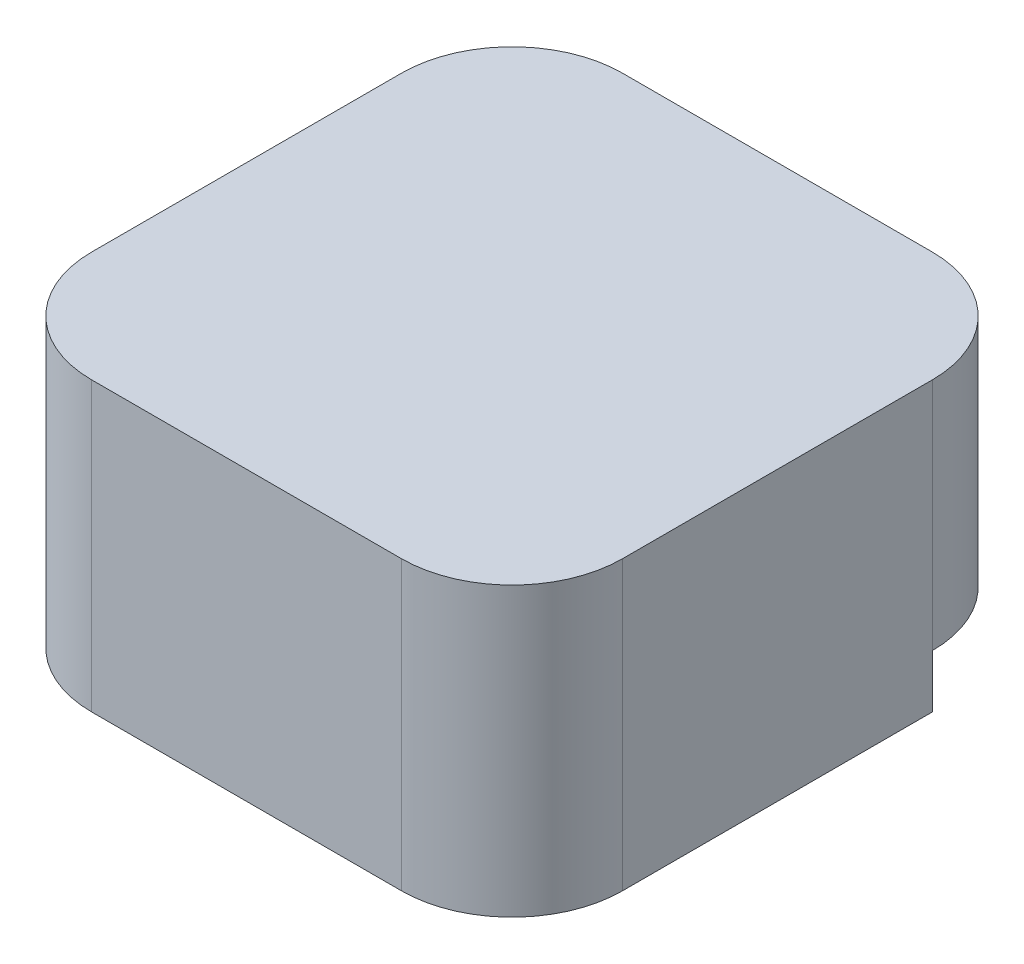
ISO-10303-21;
HEADER;
FILE_DESCRIPTION(('STEP AP214'),'2;1');
FILE_NAME('part.step','',(''),(''),'','','');
FILE_SCHEMA(('AUTOMOTIVE_DESIGN { 1 0 10303 214 1 1 1 1 }'));
ENDSEC;
DATA;
#1=APPLICATION_CONTEXT('core data for automotive mechanical design processes');
#2=APPLICATION_PROTOCOL_DEFINITION('international standard','automotive_design',2000,#1);
#3=PRODUCT_CONTEXT('',#1,'mechanical');
#4=PRODUCT('Part','Part','',(#3));
#5=PRODUCT_RELATED_PRODUCT_CATEGORY('part','',(#4));
#6=PRODUCT_DEFINITION_FORMATION('','',#4);
#7=PRODUCT_DEFINITION_CONTEXT('part definition',#1,'design');
#8=PRODUCT_DEFINITION('design','',#6,#7);
#9=PRODUCT_DEFINITION_SHAPE('','',#8);
#10=(LENGTH_UNIT() NAMED_UNIT(*) SI_UNIT(.MILLI.,.METRE.));
#11=(NAMED_UNIT(*) PLANE_ANGLE_UNIT() SI_UNIT($,.RADIAN.));
#12=(NAMED_UNIT(*) SI_UNIT($,.STERADIAN.) SOLID_ANGLE_UNIT());
#13=UNCERTAINTY_MEASURE_WITH_UNIT(LENGTH_MEASURE(1.E-05),#10,'distance_accuracy_value','');
#14=(GEOMETRIC_REPRESENTATION_CONTEXT(3) GLOBAL_UNCERTAINTY_ASSIGNED_CONTEXT((#13)) GLOBAL_UNIT_ASSIGNED_CONTEXT((#10,
#11,#12)) REPRESENTATION_CONTEXT('',''));
#15=CARTESIAN_POINT('',(0.,0.,0.));
#16=DIRECTION('',(0.,0.,1.));
#17=DIRECTION('',(1.,0.,0.));
#18=AXIS2_PLACEMENT_3D('',#15,#16,#17);
#19=CARTESIAN_POINT('',(0.,0.,0.));
#20=DIRECTION('',(0.,-1.,0.));
#21=DIRECTION('',(0.,0.,-1.));
#22=AXIS2_PLACEMENT_3D('',#19,#20,#21);
#23=PLANE('',#22);
#24=DIRECTION('',(1.,0.,0.));
#25=VECTOR('',#24,1.);
#26=CARTESIAN_POINT('',(0.,0.,-9.5));
#27=LINE('',#26,#25);
#28=CARTESIAN_POINT('',(0.,0.,-9.5));
#29=VERTEX_POINT('',#28);
#30=CARTESIAN_POINT('',(12.,0.,-9.5));
#31=VERTEX_POINT('',#30);
#32=EDGE_CURVE('E138',#29,#31,#27,.T.);
#33=ORIENTED_EDGE('',*,*,#32,.T.);
#34=DIRECTION('',(0.,0.,-1.));
#35=VECTOR('',#34,1.);
#36=CARTESIAN_POINT('',(12.,0.,0.));
#37=LINE('',#36,#35);
#38=CARTESIAN_POINT('',(12.,0.,-2.5));
#39=VERTEX_POINT('',#38);
#40=EDGE_CURVE('E177',#39,#31,#37,.T.);
#41=ORIENTED_EDGE('',*,*,#40,.F.);
#42=CARTESIAN_POINT('',(9.5,0.,-2.5));
#43=DIRECTION('',(0.,-1.,0.));
#44=DIRECTION('',(0.,0.,-1.));
#45=AXIS2_PLACEMENT_3D('',#42,#43,#44);
#46=CIRCLE('',#45,2.5);
#47=CARTESIAN_POINT('',(9.5,0.,0.));
#48=VERTEX_POINT('',#47);
#49=EDGE_CURVE('E176',#39,#48,#46,.T.);
#50=ORIENTED_EDGE('',*,*,#49,.T.);
#51=DIRECTION('',(1.,0.,0.));
#52=VECTOR('',#51,1.);
#53=CARTESIAN_POINT('',(0.,0.,0.));
#54=LINE('',#53,#52);
#55=CARTESIAN_POINT('',(2.5,0.,0.));
#56=VERTEX_POINT('',#55);
#57=EDGE_CURVE('E169',#56,#48,#54,.T.);
#58=ORIENTED_EDGE('',*,*,#57,.F.);
#59=CARTESIAN_POINT('',(2.5,0.,-2.5));
#60=DIRECTION('',(0.,-1.,0.));
#61=DIRECTION('',(0.,0.,-1.));
#62=AXIS2_PLACEMENT_3D('',#59,#60,#61);
#63=CIRCLE('',#62,2.5);
#64=CARTESIAN_POINT('',(0.,0.,-2.5));
#65=VERTEX_POINT('',#64);
#66=EDGE_CURVE('E174',#56,#65,#63,.T.);
#67=ORIENTED_EDGE('',*,*,#66,.T.);
#68=DIRECTION('',(0.,0.,1.));
#69=VECTOR('',#68,1.);
#70=CARTESIAN_POINT('',(0.,0.,0.));
#71=LINE('',#70,#69);
#72=EDGE_CURVE('E178',#29,#65,#71,.T.);
#73=ORIENTED_EDGE('',*,*,#72,.F.);
#74=EDGE_LOOP('',(#33,#41,#50,#58,#67,#73));
#75=FACE_BOUND('',#74,.T.);
#76=DIRECTION('',(-1.,0.,0.));
#77=VECTOR('',#76,1.);
#78=CARTESIAN_POINT('',(3.95,0.,-8.05));
#79=LINE('',#78,#77);
#80=CARTESIAN_POINT('',(8.05,0.,-8.05));
#81=VERTEX_POINT('',#80);
#82=CARTESIAN_POINT('',(3.95,0.,-8.05));
#83=VERTEX_POINT('',#82);
#84=EDGE_CURVE('E229',#81,#83,#79,.T.);
#85=ORIENTED_EDGE('',*,*,#84,.T.);
#86=DIRECTION('',(0.,0.,1.));
#87=VECTOR('',#86,1.);
#88=CARTESIAN_POINT('',(3.95,0.,-3.95));
#89=LINE('',#88,#87);
#90=CARTESIAN_POINT('',(3.95,0.,-3.95));
#91=VERTEX_POINT('',#90);
#92=EDGE_CURVE('E215',#83,#91,#89,.T.);
#93=ORIENTED_EDGE('',*,*,#92,.T.);
#94=DIRECTION('',(1.,0.,0.));
#95=VECTOR('',#94,1.);
#96=CARTESIAN_POINT('',(3.95,0.,-3.95));
#97=LINE('',#96,#95);
#98=CARTESIAN_POINT('',(8.05,0.,-3.95));
#99=VERTEX_POINT('',#98);
#100=EDGE_CURVE('E241',#91,#99,#97,.T.);
#101=ORIENTED_EDGE('',*,*,#100,.T.);
#102=DIRECTION('',(0.,0.,-1.));
#103=VECTOR('',#102,1.);
#104=CARTESIAN_POINT('',(8.05,0.,-3.95));
#105=LINE('',#104,#103);
#106=EDGE_CURVE('E244',#99,#81,#105,.T.);
#107=ORIENTED_EDGE('',*,*,#106,.T.);
#108=EDGE_LOOP('',(#85,#93,#101,#107));
#109=FACE_BOUND('',#108,.T.);
#110=ADVANCED_FACE('F33',(#75,#109),#23,.T.);
#111=CARTESIAN_POINT('',(0.,2.5,0.));
#112=DIRECTION('',(1.,0.,0.));
#113=DIRECTION('',(0.,0.,-1.));
#114=AXIS2_PLACEMENT_3D('',#111,#112,#113);
#115=PLANE('',#114);
#116=DIRECTION('',(0.,0.,1.));
#117=VECTOR('',#116,1.);
#118=CARTESIAN_POINT('',(0.,6.5,0.));
#119=LINE('',#118,#117);
#120=CARTESIAN_POINT('',(0.,6.5,-9.5));
#121=VERTEX_POINT('',#120);
#122=CARTESIAN_POINT('',(0.,6.5,-2.5));
#123=VERTEX_POINT('',#122);
#124=EDGE_CURVE('E158',#121,#123,#119,.T.);
#125=ORIENTED_EDGE('',*,*,#124,.F.);
#126=DIRECTION('',(0.,-1.,0.));
#127=VECTOR('',#126,1.);
#128=CARTESIAN_POINT('',(0.,2.5,-9.5));
#129=LINE('',#128,#127);
#130=CARTESIAN_POINT('',(0.,1.2,-9.5));
#131=VERTEX_POINT('',#130);
#132=EDGE_CURVE('E154',#121,#131,#129,.T.);
#133=ORIENTED_EDGE('',*,*,#132,.T.);
#134=DIRECTION('',(0.,-1.,0.));
#135=VECTOR('',#134,1.);
#136=CARTESIAN_POINT('',(0.,0.,-9.5));
#137=LINE('',#136,#135);
#138=EDGE_CURVE('E141',#131,#29,#137,.T.);
#139=ORIENTED_EDGE('',*,*,#138,.T.);
#140=ORIENTED_EDGE('',*,*,#72,.T.);
#141=DIRECTION('',(0.,-1.,0.));
#142=VECTOR('',#141,1.);
#143=CARTESIAN_POINT('',(0.,2.5,-2.5));
#144=LINE('',#143,#142);
#145=EDGE_CURVE('E159',#65,#123,#144,.F.);
#146=ORIENTED_EDGE('',*,*,#145,.T.);
#147=EDGE_LOOP('',(#125,#133,#139,#140,#146));
#148=FACE_BOUND('',#147,.T.);
#149=ADVANCED_FACE('F157',(#148),#115,.F.);
#150=CARTESIAN_POINT('',(0.,2.5,0.));
#151=DIRECTION('',(0.,0.,-1.));
#152=DIRECTION('',(-1.,0.,0.));
#153=AXIS2_PLACEMENT_3D('',#150,#151,#152);
#154=PLANE('',#153);
#155=DIRECTION('',(1.,0.,0.));
#156=VECTOR('',#155,1.);
#157=CARTESIAN_POINT('',(0.,6.5,0.));
#158=LINE('',#157,#156);
#159=CARTESIAN_POINT('',(2.5,6.5,0.));
#160=VERTEX_POINT('',#159);
#161=CARTESIAN_POINT('',(9.5,6.5,0.));
#162=VERTEX_POINT('',#161);
#163=EDGE_CURVE('E170',#160,#162,#158,.T.);
#164=ORIENTED_EDGE('',*,*,#163,.F.);
#165=DIRECTION('',(0.,-1.,0.));
#166=VECTOR('',#165,1.);
#167=CARTESIAN_POINT('',(2.5,2.5,0.));
#168=LINE('',#167,#166);
#169=EDGE_CURVE('E41',#160,#56,#168,.T.);
#170=ORIENTED_EDGE('',*,*,#169,.T.);
#171=ORIENTED_EDGE('',*,*,#57,.T.);
#172=DIRECTION('',(0.,-1.,0.));
#173=VECTOR('',#172,1.);
#174=CARTESIAN_POINT('',(9.5,2.5,0.));
#175=LINE('',#174,#173);
#176=EDGE_CURVE('E48',#48,#162,#175,.F.);
#177=ORIENTED_EDGE('',*,*,#176,.T.);
#178=EDGE_LOOP('',(#164,#170,#171,#177));
#179=FACE_BOUND('',#178,.T.);
#180=ADVANCED_FACE('F168',(#179),#154,.F.);
#181=CARTESIAN_POINT('',(12.,2.5,0.));
#182=DIRECTION('',(-1.,0.,0.));
#183=DIRECTION('',(0.,0.,1.));
#184=AXIS2_PLACEMENT_3D('',#181,#182,#183);
#185=PLANE('',#184);
#186=ORIENTED_EDGE('',*,*,#40,.T.);
#187=DIRECTION('',(0.,-1.,0.));
#188=VECTOR('',#187,1.);
#189=CARTESIAN_POINT('',(12.,2.5,-9.5));
#190=LINE('',#189,#188);
#191=CARTESIAN_POINT('',(12.,1.2,-9.5));
#192=VERTEX_POINT('',#191);
#193=EDGE_CURVE('E196',#31,#192,#190,.F.);
#194=ORIENTED_EDGE('',*,*,#193,.T.);
#195=CARTESIAN_POINT('',(12.,6.5,-9.5));
#196=VERTEX_POINT('',#195);
#197=EDGE_CURVE('E195',#192,#196,#190,.F.);
#198=ORIENTED_EDGE('',*,*,#197,.T.);
#199=DIRECTION('',(0.,0.,-1.));
#200=VECTOR('',#199,1.);
#201=CARTESIAN_POINT('',(12.,6.5,0.));
#202=LINE('',#201,#200);
#203=CARTESIAN_POINT('',(12.,6.5,-2.5));
#204=VERTEX_POINT('',#203);
#205=EDGE_CURVE('E210',#204,#196,#202,.T.);
#206=ORIENTED_EDGE('',*,*,#205,.F.);
#207=DIRECTION('',(0.,-1.,0.));
#208=VECTOR('',#207,1.);
#209=CARTESIAN_POINT('',(12.,2.5,-2.5));
#210=LINE('',#209,#208);
#211=EDGE_CURVE('E192',#204,#39,#210,.T.);
#212=ORIENTED_EDGE('',*,*,#211,.T.);
#213=EDGE_LOOP('',(#186,#194,#198,#206,#212));
#214=FACE_BOUND('',#213,.T.);
#215=ADVANCED_FACE('F289',(#214),#185,.F.);
#216=CARTESIAN_POINT('',(0.,2.5,-12.));
#217=DIRECTION('',(0.,0.,1.));
#218=DIRECTION('',(1.,0.,0.));
#219=AXIS2_PLACEMENT_3D('',#216,#217,#218);
#220=PLANE('',#219);
#221=DIRECTION('',(0.,-1.,0.));
#222=VECTOR('',#221,1.);
#223=CARTESIAN_POINT('',(9.5,2.5,-12.));
#224=LINE('',#223,#222);
#225=CARTESIAN_POINT('',(9.5,6.5,-12.));
#226=VERTEX_POINT('',#225);
#227=CARTESIAN_POINT('',(9.5,1.2,-12.));
#228=VERTEX_POINT('',#227);
#229=EDGE_CURVE('E187',#226,#228,#224,.T.);
#230=ORIENTED_EDGE('',*,*,#229,.T.);
#231=DIRECTION('',(-1.,0.,0.));
#232=VECTOR('',#231,1.);
#233=CARTESIAN_POINT('',(0.,1.2,-12.));
#234=LINE('',#233,#232);
#235=CARTESIAN_POINT('',(2.5,1.2,-12.));
#236=VERTEX_POINT('',#235);
#237=EDGE_CURVE('E137',#228,#236,#234,.T.);
#238=ORIENTED_EDGE('',*,*,#237,.T.);
#239=DIRECTION('',(0.,-1.,0.));
#240=VECTOR('',#239,1.);
#241=CARTESIAN_POINT('',(2.5,2.5,-12.));
#242=LINE('',#241,#240);
#243=CARTESIAN_POINT('',(2.5,6.5,-12.));
#244=VERTEX_POINT('',#243);
#245=EDGE_CURVE('E155',#236,#244,#242,.F.);
#246=ORIENTED_EDGE('',*,*,#245,.T.);
#247=DIRECTION('',(-1.,0.,0.));
#248=VECTOR('',#247,1.);
#249=CARTESIAN_POINT('',(0.,6.5,-12.));
#250=LINE('',#249,#248);
#251=EDGE_CURVE('E208',#226,#244,#250,.T.);
#252=ORIENTED_EDGE('',*,*,#251,.F.);
#253=EDGE_LOOP('',(#230,#238,#246,#252));
#254=FACE_BOUND('',#253,.T.);
#255=ADVANCED_FACE('F214',(#254),#220,.F.);
#256=CARTESIAN_POINT('',(3.95,2.5,-3.95));
#257=DIRECTION('',(1.,0.,0.));
#258=DIRECTION('',(0.,0.,-1.));
#259=AXIS2_PLACEMENT_3D('',#256,#257,#258);
#260=PLANE('',#259);
#261=ORIENTED_EDGE('',*,*,#92,.F.);
#262=DIRECTION('',(0.,-1.,0.));
#263=VECTOR('',#262,1.);
#264=CARTESIAN_POINT('',(3.95,2.5,-8.05));
#265=LINE('',#264,#263);
#266=CARTESIAN_POINT('',(3.95,2.5,-8.05));
#267=VERTEX_POINT('',#266);
#268=EDGE_CURVE('E238',#267,#83,#265,.T.);
#269=ORIENTED_EDGE('',*,*,#268,.F.);
#270=DIRECTION('',(0.,0.,1.));
#271=VECTOR('',#270,1.);
#272=CARTESIAN_POINT('',(3.95,2.5,-3.95));
#273=LINE('',#272,#271);
#274=CARTESIAN_POINT('',(3.95,2.5,-3.95));
#275=VERTEX_POINT('',#274);
#276=EDGE_CURVE('E225',#267,#275,#273,.T.);
#277=ORIENTED_EDGE('',*,*,#276,.T.);
#278=DIRECTION('',(0.,-1.,0.));
#279=VECTOR('',#278,1.);
#280=CARTESIAN_POINT('',(3.95,2.5,-3.95));
#281=LINE('',#280,#279);
#282=EDGE_CURVE('E182',#275,#91,#281,.T.);
#283=ORIENTED_EDGE('',*,*,#282,.T.);
#284=EDGE_LOOP('',(#261,#269,#277,#283));
#285=FACE_BOUND('',#284,.T.);
#286=ADVANCED_FACE('F257',(#285),#260,.T.);
#287=CARTESIAN_POINT('',(3.95,2.5,-3.95));
#288=DIRECTION('',(0.,0.,-1.));
#289=DIRECTION('',(-1.,0.,0.));
#290=AXIS2_PLACEMENT_3D('',#287,#288,#289);
#291=PLANE('',#290);
#292=ORIENTED_EDGE('',*,*,#100,.F.);
#293=ORIENTED_EDGE('',*,*,#282,.F.);
#294=DIRECTION('',(1.,0.,0.));
#295=VECTOR('',#294,1.);
#296=CARTESIAN_POINT('',(3.95,2.5,-3.95));
#297=LINE('',#296,#295);
#298=CARTESIAN_POINT('',(8.05,2.5,-3.95));
#299=VERTEX_POINT('',#298);
#300=EDGE_CURVE('E228',#275,#299,#297,.T.);
#301=ORIENTED_EDGE('',*,*,#300,.T.);
#302=DIRECTION('',(0.,-1.,0.));
#303=VECTOR('',#302,1.);
#304=CARTESIAN_POINT('',(8.05,2.5,-3.95));
#305=LINE('',#304,#303);
#306=EDGE_CURVE('E253',#299,#99,#305,.T.);
#307=ORIENTED_EDGE('',*,*,#306,.T.);
#308=EDGE_LOOP('',(#292,#293,#301,#307));
#309=FACE_BOUND('',#308,.T.);
#310=ADVANCED_FACE('F268',(#309),#291,.T.);
#311=CARTESIAN_POINT('',(8.05,2.5,-3.95));
#312=DIRECTION('',(-1.,0.,0.));
#313=DIRECTION('',(0.,0.,1.));
#314=AXIS2_PLACEMENT_3D('',#311,#312,#313);
#315=PLANE('',#314);
#316=ORIENTED_EDGE('',*,*,#106,.F.);
#317=ORIENTED_EDGE('',*,*,#306,.F.);
#318=DIRECTION('',(0.,0.,-1.));
#319=VECTOR('',#318,1.);
#320=CARTESIAN_POINT('',(8.05,2.5,-3.95));
#321=LINE('',#320,#319);
#322=CARTESIAN_POINT('',(8.05,2.5,-8.05));
#323=VERTEX_POINT('',#322);
#324=EDGE_CURVE('E232',#299,#323,#321,.T.);
#325=ORIENTED_EDGE('',*,*,#324,.T.);
#326=DIRECTION('',(0.,-1.,0.));
#327=VECTOR('',#326,1.);
#328=CARTESIAN_POINT('',(8.05,2.5,-8.05));
#329=LINE('',#328,#327);
#330=EDGE_CURVE('E251',#323,#81,#329,.T.);
#331=ORIENTED_EDGE('',*,*,#330,.T.);
#332=EDGE_LOOP('',(#316,#317,#325,#331));
#333=FACE_BOUND('',#332,.T.);
#334=ADVANCED_FACE('F270',(#333),#315,.T.);
#335=CARTESIAN_POINT('',(3.95,2.5,-8.05));
#336=DIRECTION('',(0.,0.,1.));
#337=DIRECTION('',(1.,0.,0.));
#338=AXIS2_PLACEMENT_3D('',#335,#336,#337);
#339=PLANE('',#338);
#340=ORIENTED_EDGE('',*,*,#84,.F.);
#341=ORIENTED_EDGE('',*,*,#330,.F.);
#342=DIRECTION('',(-1.,0.,0.));
#343=VECTOR('',#342,1.);
#344=CARTESIAN_POINT('',(3.95,2.5,-8.05));
#345=LINE('',#344,#343);
#346=EDGE_CURVE('E235',#323,#267,#345,.T.);
#347=ORIENTED_EDGE('',*,*,#346,.T.);
#348=ORIENTED_EDGE('',*,*,#268,.T.);
#349=EDGE_LOOP('',(#340,#341,#347,#348));
#350=FACE_BOUND('',#349,.T.);
#351=ADVANCED_FACE('F264',(#350),#339,.T.);
#352=CARTESIAN_POINT('',(0.,2.5,0.));
#353=DIRECTION('',(0.,-1.,0.));
#354=DIRECTION('',(0.,0.,-1.));
#355=AXIS2_PLACEMENT_3D('',#352,#353,#354);
#356=PLANE('',#355);
#357=ORIENTED_EDGE('',*,*,#276,.F.);
#358=ORIENTED_EDGE('',*,*,#346,.F.);
#359=ORIENTED_EDGE('',*,*,#324,.F.);
#360=ORIENTED_EDGE('',*,*,#300,.F.);
#361=EDGE_LOOP('',(#357,#358,#359,#360));
#362=FACE_BOUND('',#361,.T.);
#363=ADVANCED_FACE('F266',(#362),#356,.T.);
#364=CARTESIAN_POINT('',(0.,6.5,0.));
#365=DIRECTION('',(0.,-1.,0.));
#366=DIRECTION('',(0.,0.,-1.));
#367=AXIS2_PLACEMENT_3D('',#364,#365,#366);
#368=PLANE('',#367);
#369=ORIENTED_EDGE('',*,*,#205,.T.);
#370=CARTESIAN_POINT('',(9.5,6.5,-9.5));
#371=DIRECTION('',(0.,-1.,0.));
#372=DIRECTION('',(0.,0.,-1.));
#373=AXIS2_PLACEMENT_3D('',#370,#371,#372);
#374=CIRCLE('',#373,2.5);
#375=EDGE_CURVE('E162',#196,#226,#374,.F.);
#376=ORIENTED_EDGE('',*,*,#375,.T.);
#377=ORIENTED_EDGE('',*,*,#251,.T.);
#378=CARTESIAN_POINT('',(2.5,6.5,-9.5));
#379=DIRECTION('',(0.,-1.,0.));
#380=DIRECTION('',(0.,0.,-1.));
#381=AXIS2_PLACEMENT_3D('',#378,#379,#380);
#382=CIRCLE('',#381,2.5);
#383=EDGE_CURVE('E202',#244,#121,#382,.F.);
#384=ORIENTED_EDGE('',*,*,#383,.T.);
#385=ORIENTED_EDGE('',*,*,#124,.T.);
#386=CARTESIAN_POINT('',(2.5,6.5,-2.5));
#387=DIRECTION('',(0.,-1.,0.));
#388=DIRECTION('',(0.,0.,-1.));
#389=AXIS2_PLACEMENT_3D('',#386,#387,#388);
#390=CIRCLE('',#389,2.5);
#391=EDGE_CURVE('E55',#123,#160,#390,.F.);
#392=ORIENTED_EDGE('',*,*,#391,.T.);
#393=ORIENTED_EDGE('',*,*,#163,.T.);
#394=CARTESIAN_POINT('',(9.5,6.5,-2.5));
#395=DIRECTION('',(0.,-1.,0.));
#396=DIRECTION('',(0.,0.,-1.));
#397=AXIS2_PLACEMENT_3D('',#394,#395,#396);
#398=CIRCLE('',#397,2.5);
#399=EDGE_CURVE('E199',#162,#204,#398,.F.);
#400=ORIENTED_EDGE('',*,*,#399,.T.);
#401=EDGE_LOOP('',(#369,#376,#377,#384,#385,#392,#393,#400));
#402=FACE_BOUND('',#401,.T.);
#403=ADVANCED_FACE('F207',(#402),#368,.F.);
#404=CARTESIAN_POINT('',(9.5,2.5,-9.5));
#405=DIRECTION('',(0.,-1.,0.));
#406=DIRECTION('',(0.,0.,-1.));
#407=AXIS2_PLACEMENT_3D('',#404,#405,#406);
#408=CYLINDRICAL_SURFACE('',#407,2.5);
#409=CARTESIAN_POINT('',(9.5,1.2,-9.5));
#410=DIRECTION('',(0.,1.,0.));
#411=DIRECTION('',(0.,0.,1.));
#412=AXIS2_PLACEMENT_3D('',#409,#410,#411);
#413=CIRCLE('',#412,2.5);
#414=EDGE_CURVE('E134',#228,#192,#413,.F.);
#415=ORIENTED_EDGE('',*,*,#414,.F.);
#416=ORIENTED_EDGE('',*,*,#229,.F.);
#417=ORIENTED_EDGE('',*,*,#375,.F.);
#418=ORIENTED_EDGE('',*,*,#197,.F.);
#419=EDGE_LOOP('',(#415,#416,#417,#418));
#420=FACE_BOUND('',#419,.T.);
#421=ADVANCED_FACE('F217',(#420),#408,.T.);
#422=CARTESIAN_POINT('',(2.5,2.5,-9.5));
#423=DIRECTION('',(0.,-1.,0.));
#424=DIRECTION('',(0.,0.,-1.));
#425=AXIS2_PLACEMENT_3D('',#422,#423,#424);
#426=CYLINDRICAL_SURFACE('',#425,2.5);
#427=CARTESIAN_POINT('',(2.5,1.2,-9.5));
#428=DIRECTION('',(0.,1.,0.));
#429=DIRECTION('',(0.,0.,1.));
#430=AXIS2_PLACEMENT_3D('',#427,#428,#429);
#431=CIRCLE('',#430,2.5);
#432=EDGE_CURVE('E11',#131,#236,#431,.F.);
#433=ORIENTED_EDGE('',*,*,#432,.F.);
#434=ORIENTED_EDGE('',*,*,#132,.F.);
#435=ORIENTED_EDGE('',*,*,#383,.F.);
#436=ORIENTED_EDGE('',*,*,#245,.F.);
#437=EDGE_LOOP('',(#433,#434,#435,#436));
#438=FACE_BOUND('',#437,.T.);
#439=ADVANCED_FACE('F152',(#438),#426,.T.);
#440=CARTESIAN_POINT('',(2.5,2.5,-2.5));
#441=DIRECTION('',(0.,-1.,0.));
#442=DIRECTION('',(0.,0.,-1.));
#443=AXIS2_PLACEMENT_3D('',#440,#441,#442);
#444=CYLINDRICAL_SURFACE('',#443,2.5);
#445=ORIENTED_EDGE('',*,*,#391,.F.);
#446=ORIENTED_EDGE('',*,*,#145,.F.);
#447=ORIENTED_EDGE('',*,*,#66,.F.);
#448=ORIENTED_EDGE('',*,*,#169,.F.);
#449=EDGE_LOOP('',(#445,#446,#447,#448));
#450=FACE_BOUND('',#449,.T.);
#451=ADVANCED_FACE('F298',(#450),#444,.T.);
#452=CARTESIAN_POINT('',(9.5,2.5,-2.5));
#453=DIRECTION('',(0.,-1.,0.));
#454=DIRECTION('',(0.,0.,-1.));
#455=AXIS2_PLACEMENT_3D('',#452,#453,#454);
#456=CYLINDRICAL_SURFACE('',#455,2.5);
#457=ORIENTED_EDGE('',*,*,#399,.F.);
#458=ORIENTED_EDGE('',*,*,#176,.F.);
#459=ORIENTED_EDGE('',*,*,#49,.F.);
#460=ORIENTED_EDGE('',*,*,#211,.F.);
#461=EDGE_LOOP('',(#457,#458,#459,#460));
#462=FACE_BOUND('',#461,.T.);
#463=ADVANCED_FACE('F35',(#462),#456,.T.);
#464=CARTESIAN_POINT('',(0.,0.,-9.5));
#465=DIRECTION('',(0.,0.,1.));
#466=DIRECTION('',(1.,0.,0.));
#467=AXIS2_PLACEMENT_3D('',#464,#465,#466);
#468=PLANE('',#467);
#469=ORIENTED_EDGE('',*,*,#193,.F.);
#470=ORIENTED_EDGE('',*,*,#32,.F.);
#471=ORIENTED_EDGE('',*,*,#138,.F.);
#472=DIRECTION('',(1.,0.,0.));
#473=VECTOR('',#472,1.);
#474=CARTESIAN_POINT('',(0.,1.2,-9.5));
#475=LINE('',#474,#473);
#476=EDGE_CURVE('E128',#131,#192,#475,.T.);
#477=ORIENTED_EDGE('',*,*,#476,.T.);
#478=EDGE_LOOP('',(#469,#470,#471,#477));
#479=FACE_BOUND('',#478,.T.);
#480=ADVANCED_FACE('F142',(#479),#468,.F.);
#481=CARTESIAN_POINT('',(0.,1.2,-9.5));
#482=DIRECTION('',(0.,1.,0.));
#483=DIRECTION('',(0.,0.,1.));
#484=AXIS2_PLACEMENT_3D('',#481,#482,#483);
#485=PLANE('',#484);
#486=ORIENTED_EDGE('',*,*,#414,.T.);
#487=ORIENTED_EDGE('',*,*,#476,.F.);
#488=ORIENTED_EDGE('',*,*,#432,.T.);
#489=ORIENTED_EDGE('',*,*,#237,.F.);
#490=EDGE_LOOP('',(#486,#487,#488,#489));
#491=FACE_BOUND('',#490,.T.);
#492=ADVANCED_FACE('F130',(#491),#485,.F.);
#493=CLOSED_SHELL('',(#110,#149,#180,#215,#255,#286,#310,#334,#351,#363,#403,#421,#439,#451,
#463,#480,#492));
#494=MANIFOLD_SOLID_BREP('B2',#493);
#495=ADVANCED_BREP_SHAPE_REPRESENTATION('',(#18,#494),#14);
#496=SHAPE_DEFINITION_REPRESENTATION(#9,#495);
ENDSEC;
END-ISO-10303-21;
